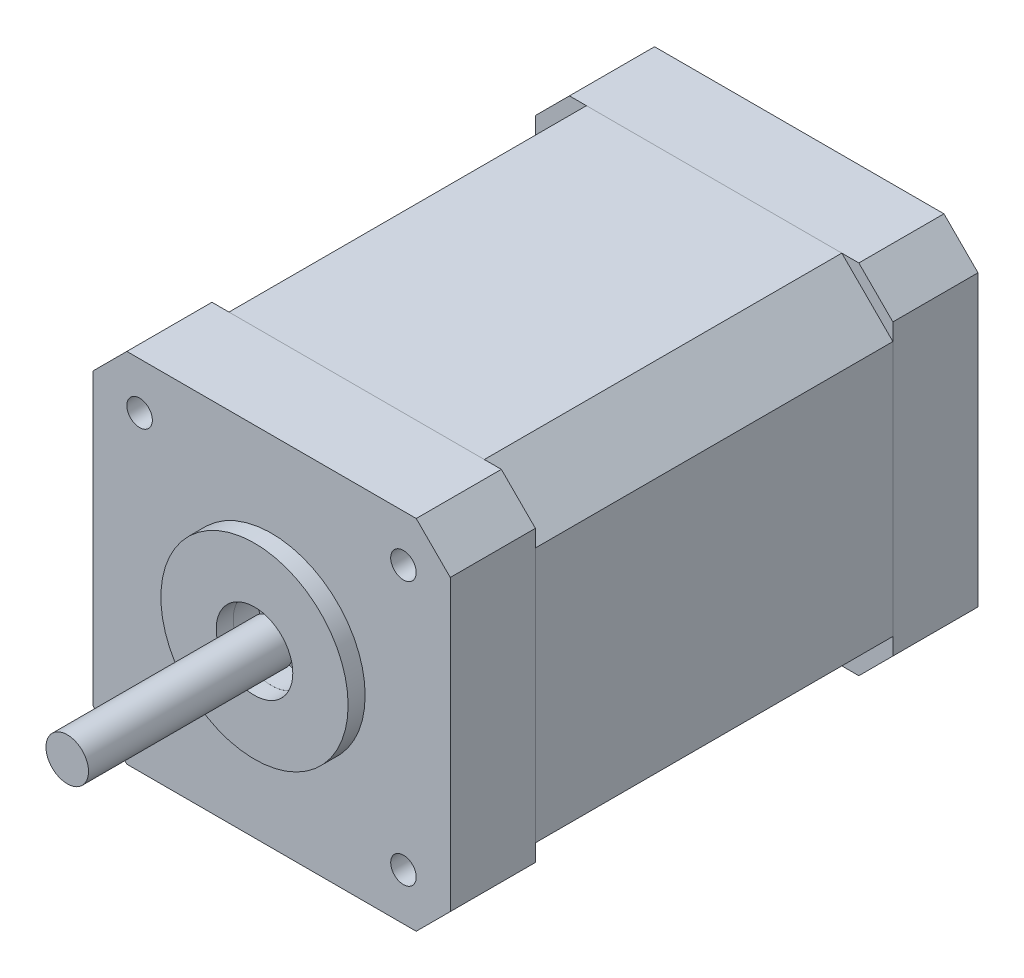
ISO-10303-21;
HEADER;
FILE_DESCRIPTION(('STEP AP214'),'2;1');
FILE_NAME('part.step','',(''),(''),'','','');
FILE_SCHEMA(('AUTOMOTIVE_DESIGN { 1 0 10303 214 1 1 1 1 }'));
ENDSEC;
DATA;
#1=APPLICATION_CONTEXT('core data for automotive mechanical design processes');
#2=APPLICATION_PROTOCOL_DEFINITION('international standard','automotive_design',2000,#1);
#3=PRODUCT_CONTEXT('',#1,'mechanical');
#4=PRODUCT('Part','Part','',(#3));
#5=PRODUCT_RELATED_PRODUCT_CATEGORY('part','',(#4));
#6=PRODUCT_DEFINITION_FORMATION('','',#4);
#7=PRODUCT_DEFINITION_CONTEXT('part definition',#1,'design');
#8=PRODUCT_DEFINITION('design','',#6,#7);
#9=PRODUCT_DEFINITION_SHAPE('','',#8);
#10=(LENGTH_UNIT() NAMED_UNIT(*) SI_UNIT(.MILLI.,.METRE.));
#11=(NAMED_UNIT(*) PLANE_ANGLE_UNIT() SI_UNIT($,.RADIAN.));
#12=(NAMED_UNIT(*) SI_UNIT($,.STERADIAN.) SOLID_ANGLE_UNIT());
#13=UNCERTAINTY_MEASURE_WITH_UNIT(LENGTH_MEASURE(1.E-05),#10,'distance_accuracy_value','');
#14=(GEOMETRIC_REPRESENTATION_CONTEXT(3) GLOBAL_UNCERTAINTY_ASSIGNED_CONTEXT((#13)) GLOBAL_UNIT_ASSIGNED_CONTEXT((#10,
#11,#12)) REPRESENTATION_CONTEXT('',''));
#15=CARTESIAN_POINT('',(0.,0.,0.));
#16=DIRECTION('',(0.,0.,1.));
#17=DIRECTION('',(1.,0.,0.));
#18=AXIS2_PLACEMENT_3D('',#15,#16,#17);
#19=CARTESIAN_POINT('',(0.,0.,84.0710678118655));
#20=DIRECTION('',(0.,0.,-1.));
#21=DIRECTION('',(-1.,0.,0.));
#22=AXIS2_PLACEMENT_3D('',#19,#20,#21);
#23=CYLINDRICAL_SURFACE('',#22,2.5);
#24=CARTESIAN_POINT('',(0.,0.,31.));
#25=DIRECTION('',(0.,0.,1.));
#26=DIRECTION('',(1.,0.,0.));
#27=AXIS2_PLACEMENT_3D('',#24,#25,#26);
#28=CIRCLE('',#27,2.5);
#29=CARTESIAN_POINT('',(2.5,0.,31.));
#30=VERTEX_POINT('',#29);
#31=EDGE_CURVE('E51',#30,#30,#28,.T.);
#32=ORIENTED_EDGE('',*,*,#31,.T.);
#33=EDGE_LOOP('',(#32));
#34=FACE_BOUND('',#33,.T.);
#35=CARTESIAN_POINT('',(0.,0.,55.));
#36=DIRECTION('',(0.,0.,1.));
#37=DIRECTION('',(1.,0.,0.));
#38=AXIS2_PLACEMENT_3D('',#35,#36,#37);
#39=CIRCLE('',#38,2.5);
#40=CARTESIAN_POINT('',(2.5,0.,55.));
#41=VERTEX_POINT('',#40);
#42=EDGE_CURVE('E11',#41,#41,#39,.T.);
#43=ORIENTED_EDGE('',*,*,#42,.F.);
#44=EDGE_LOOP('',(#43));
#45=FACE_BOUND('',#44,.T.);
#46=ADVANCED_FACE('F44',(#34,#45),#23,.T.);
#47=CARTESIAN_POINT('',(0.,0.,31.));
#48=DIRECTION('',(0.,0.,1.));
#49=DIRECTION('',(1.,0.,0.));
#50=AXIS2_PLACEMENT_3D('',#47,#48,#49);
#51=PLANE('',#50);
#52=ORIENTED_EDGE('',*,*,#31,.F.);
#53=EDGE_LOOP('',(#52));
#54=FACE_BOUND('',#53,.T.);
#55=ADVANCED_FACE('F59',(#54),#51,.F.);
#56=CARTESIAN_POINT('',(0.,0.,55.));
#57=DIRECTION('',(0.,0.,1.));
#58=DIRECTION('',(1.,0.,0.));
#59=AXIS2_PLACEMENT_3D('',#56,#57,#58);
#60=PLANE('',#59);
#61=ORIENTED_EDGE('',*,*,#42,.T.);
#62=EDGE_LOOP('',(#61));
#63=FACE_BOUND('',#62,.T.);
#64=ADVANCED_FACE('F46',(#63),#60,.T.);
#65=CLOSED_SHELL('',(#46,#55,#64));
#66=MANIFOLD_SOLID_BREP('B2',#65);
#67=CARTESIAN_POINT('',(0.,0.,33.));
#68=DIRECTION('',(0.,0.,-1.));
#69=DIRECTION('',(-1.,0.,0.));
#70=AXIS2_PLACEMENT_3D('',#67,#68,#69);
#71=CYLINDRICAL_SURFACE('',#70,11.);
#72=CARTESIAN_POINT('',(0.,0.,33.));
#73=DIRECTION('',(0.,0.,1.));
#74=DIRECTION('',(1.,0.,0.));
#75=AXIS2_PLACEMENT_3D('',#72,#73,#74);
#76=CIRCLE('',#75,11.);
#77=CARTESIAN_POINT('',(11.,0.,33.));
#78=VERTEX_POINT('',#77);
#79=EDGE_CURVE('E43',#78,#78,#76,.T.);
#80=ORIENTED_EDGE('',*,*,#79,.F.);
#81=EDGE_LOOP('',(#80));
#82=FACE_BOUND('',#81,.T.);
#83=CARTESIAN_POINT('',(0.,0.,31.));
#84=DIRECTION('',(0.,0.,1.));
#85=DIRECTION('',(1.,0.,0.));
#86=AXIS2_PLACEMENT_3D('',#83,#84,#85);
#87=CIRCLE('',#86,11.);
#88=CARTESIAN_POINT('',(11.,0.,31.));
#89=VERTEX_POINT('',#88);
#90=EDGE_CURVE('E102',#89,#89,#87,.T.);
#91=ORIENTED_EDGE('',*,*,#90,.T.);
#92=EDGE_LOOP('',(#91));
#93=FACE_BOUND('',#92,.T.);
#94=ADVANCED_FACE('F95',(#82,#93),#71,.T.);
#95=CARTESIAN_POINT('',(0.,0.,33.));
#96=DIRECTION('',(0.,0.,1.));
#97=DIRECTION('',(1.,0.,0.));
#98=AXIS2_PLACEMENT_3D('',#95,#96,#97);
#99=PLANE('',#98);
#100=CARTESIAN_POINT('',(0.,0.,33.));
#101=DIRECTION('',(0.,0.,1.));
#102=DIRECTION('',(1.,0.,0.));
#103=AXIS2_PLACEMENT_3D('',#100,#101,#102);
#104=CIRCLE('',#103,4.5);
#105=CARTESIAN_POINT('',(4.5,0.,33.));
#106=VERTEX_POINT('',#105);
#107=EDGE_CURVE('E108',#106,#106,#104,.T.);
#108=ORIENTED_EDGE('',*,*,#107,.F.);
#109=EDGE_LOOP('',(#108));
#110=FACE_BOUND('',#109,.T.);
#111=ORIENTED_EDGE('',*,*,#79,.T.);
#112=EDGE_LOOP('',(#111));
#113=FACE_BOUND('',#112,.T.);
#114=ADVANCED_FACE('F124',(#110,#113),#99,.T.);
#115=CARTESIAN_POINT('',(0.,0.,31.));
#116=DIRECTION('',(0.,0.,1.));
#117=DIRECTION('',(1.,0.,0.));
#118=AXIS2_PLACEMENT_3D('',#115,#116,#117);
#119=PLANE('',#118);
#120=CARTESIAN_POINT('',(0.,0.,31.));
#121=DIRECTION('',(0.,0.,1.));
#122=DIRECTION('',(1.,0.,0.));
#123=AXIS2_PLACEMENT_3D('',#120,#121,#122);
#124=CIRCLE('',#123,4.5);
#125=CARTESIAN_POINT('',(4.5,0.,31.));
#126=VERTEX_POINT('',#125);
#127=EDGE_CURVE('E98',#126,#126,#124,.T.);
#128=ORIENTED_EDGE('',*,*,#127,.T.);
#129=EDGE_LOOP('',(#128));
#130=FACE_BOUND('',#129,.T.);
#131=ORIENTED_EDGE('',*,*,#90,.F.);
#132=EDGE_LOOP('',(#131));
#133=FACE_BOUND('',#132,.T.);
#134=ADVANCED_FACE('F115',(#130,#133),#119,.F.);
#135=CARTESIAN_POINT('',(0.,0.,28.));
#136=DIRECTION('',(0.,0.,1.));
#137=DIRECTION('',(1.,0.,0.));
#138=AXIS2_PLACEMENT_3D('',#135,#136,#137);
#139=CYLINDRICAL_SURFACE('',#138,4.5);
#140=ORIENTED_EDGE('',*,*,#107,.T.);
#141=EDGE_LOOP('',(#140));
#142=FACE_BOUND('',#141,.T.);
#143=ORIENTED_EDGE('',*,*,#127,.F.);
#144=EDGE_LOOP('',(#143));
#145=FACE_BOUND('',#144,.T.);
#146=ADVANCED_FACE('F118',(#142,#145),#139,.F.);
#147=CLOSED_SHELL('',(#94,#114,#134,#146));
#148=MANIFOLD_SOLID_BREP('B6',#147);
#149=CARTESIAN_POINT('',(-21.,-21.,-31.));
#150=DIRECTION('',(1.,0.,0.));
#151=DIRECTION('',(0.,0.,-1.));
#152=AXIS2_PLACEMENT_3D('',#149,#150,#151);
#153=PLANE('',#152);
#154=DIRECTION('',(0.,1.,0.));
#155=VECTOR('',#154,1.);
#156=CARTESIAN_POINT('',(-21.,-21.,-31.));
#157=LINE('',#156,#155);
#158=CARTESIAN_POINT('',(-21.,-17.,-31.));
#159=VERTEX_POINT('',#158);
#160=CARTESIAN_POINT('',(-21.,17.,-31.));
#161=VERTEX_POINT('',#160);
#162=EDGE_CURVE('E256',#159,#161,#157,.T.);
#163=ORIENTED_EDGE('',*,*,#162,.F.);
#164=DIRECTION('',(0.,0.,1.));
#165=VECTOR('',#164,1.);
#166=CARTESIAN_POINT('',(-21.,-17.,-31.));
#167=LINE('',#166,#165);
#168=CARTESIAN_POINT('',(-21.,-17.,-21.));
#169=VERTEX_POINT('',#168);
#170=EDGE_CURVE('E241',#159,#169,#167,.T.);
#171=ORIENTED_EDGE('',*,*,#170,.T.);
#172=DIRECTION('',(0.,1.,0.));
#173=VECTOR('',#172,1.);
#174=CARTESIAN_POINT('',(-21.,-21.,-21.));
#175=LINE('',#174,#173);
#176=CARTESIAN_POINT('',(-21.,17.,-21.));
#177=VERTEX_POINT('',#176);
#178=EDGE_CURVE('E253',#169,#177,#175,.T.);
#179=ORIENTED_EDGE('',*,*,#178,.T.);
#180=DIRECTION('',(0.,0.,-1.));
#181=VECTOR('',#180,1.);
#182=CARTESIAN_POINT('',(-21.,17.,-31.));
#183=LINE('',#182,#181);
#184=EDGE_CURVE('E258',#177,#161,#183,.T.);
#185=ORIENTED_EDGE('',*,*,#184,.T.);
#186=EDGE_LOOP('',(#163,#171,#179,#185));
#187=FACE_BOUND('',#186,.T.);
#188=ADVANCED_FACE('F170',(#187),#153,.F.);
#189=CARTESIAN_POINT('',(21.,21.,-31.));
#190=DIRECTION('',(0.,-1.,0.));
#191=DIRECTION('',(0.,0.,-1.));
#192=AXIS2_PLACEMENT_3D('',#189,#190,#191);
#193=PLANE('',#192);
#194=DIRECTION('',(1.,0.,0.));
#195=VECTOR('',#194,1.);
#196=CARTESIAN_POINT('',(21.,21.,-31.));
#197=LINE('',#196,#195);
#198=CARTESIAN_POINT('',(-17.,21.,-31.));
#199=VERTEX_POINT('',#198);
#200=CARTESIAN_POINT('',(17.,21.,-31.));
#201=VERTEX_POINT('',#200);
#202=EDGE_CURVE('E296',#199,#201,#197,.T.);
#203=ORIENTED_EDGE('',*,*,#202,.F.);
#204=DIRECTION('',(0.,0.,1.));
#205=VECTOR('',#204,1.);
#206=CARTESIAN_POINT('',(-17.,21.,-31.));
#207=LINE('',#206,#205);
#208=CARTESIAN_POINT('',(-17.,21.,-21.));
#209=VERTEX_POINT('',#208);
#210=EDGE_CURVE('E93',#199,#209,#207,.T.);
#211=ORIENTED_EDGE('',*,*,#210,.T.);
#212=DIRECTION('',(1.,0.,0.));
#213=VECTOR('',#212,1.);
#214=CARTESIAN_POINT('',(21.,21.,-21.));
#215=LINE('',#214,#213);
#216=CARTESIAN_POINT('',(17.,21.,-21.));
#217=VERTEX_POINT('',#216);
#218=EDGE_CURVE('E263',#209,#217,#215,.T.);
#219=ORIENTED_EDGE('',*,*,#218,.T.);
#220=DIRECTION('',(0.,0.,-1.));
#221=VECTOR('',#220,1.);
#222=CARTESIAN_POINT('',(17.,21.,-31.));
#223=LINE('',#222,#221);
#224=EDGE_CURVE('E178',#217,#201,#223,.T.);
#225=ORIENTED_EDGE('',*,*,#224,.T.);
#226=EDGE_LOOP('',(#203,#211,#219,#225));
#227=FACE_BOUND('',#226,.T.);
#228=ADVANCED_FACE('F295',(#227),#193,.F.);
#229=CARTESIAN_POINT('',(21.,-21.,-31.));
#230=DIRECTION('',(-1.,0.,0.));
#231=DIRECTION('',(0.,0.,1.));
#232=AXIS2_PLACEMENT_3D('',#229,#230,#231);
#233=PLANE('',#232);
#234=DIRECTION('',(0.,-1.,0.));
#235=VECTOR('',#234,1.);
#236=CARTESIAN_POINT('',(21.,-21.,-21.));
#237=LINE('',#236,#235);
#238=CARTESIAN_POINT('',(21.,17.,-21.));
#239=VERTEX_POINT('',#238);
#240=CARTESIAN_POINT('',(21.,-17.,-21.));
#241=VERTEX_POINT('',#240);
#242=EDGE_CURVE('E266',#239,#241,#237,.T.);
#243=ORIENTED_EDGE('',*,*,#242,.T.);
#244=DIRECTION('',(0.,0.,-1.));
#245=VECTOR('',#244,1.);
#246=CARTESIAN_POINT('',(21.,-17.,-31.));
#247=LINE('',#246,#245);
#248=CARTESIAN_POINT('',(21.,-17.,-31.));
#249=VERTEX_POINT('',#248);
#250=EDGE_CURVE('E185',#241,#249,#247,.T.);
#251=ORIENTED_EDGE('',*,*,#250,.T.);
#252=DIRECTION('',(0.,-1.,0.));
#253=VECTOR('',#252,1.);
#254=CARTESIAN_POINT('',(21.,-21.,-31.));
#255=LINE('',#254,#253);
#256=CARTESIAN_POINT('',(21.,17.,-31.));
#257=VERTEX_POINT('',#256);
#258=EDGE_CURVE('E302',#257,#249,#255,.T.);
#259=ORIENTED_EDGE('',*,*,#258,.F.);
#260=DIRECTION('',(0.,0.,1.));
#261=VECTOR('',#260,1.);
#262=CARTESIAN_POINT('',(21.,17.,-31.));
#263=LINE('',#262,#261);
#264=EDGE_CURVE('E289',#257,#239,#263,.T.);
#265=ORIENTED_EDGE('',*,*,#264,.T.);
#266=EDGE_LOOP('',(#243,#251,#259,#265));
#267=FACE_BOUND('',#266,.T.);
#268=ADVANCED_FACE('F306',(#267),#233,.F.);
#269=CARTESIAN_POINT('',(21.,-21.,-31.));
#270=DIRECTION('',(0.,1.,0.));
#271=DIRECTION('',(0.,0.,1.));
#272=AXIS2_PLACEMENT_3D('',#269,#270,#271);
#273=PLANE('',#272);
#274=DIRECTION('',(-1.,0.,0.));
#275=VECTOR('',#274,1.);
#276=CARTESIAN_POINT('',(21.,-21.,-21.));
#277=LINE('',#276,#275);
#278=CARTESIAN_POINT('',(17.,-21.,-21.));
#279=VERTEX_POINT('',#278);
#280=CARTESIAN_POINT('',(-17.,-21.,-21.));
#281=VERTEX_POINT('',#280);
#282=EDGE_CURVE('E273',#279,#281,#277,.T.);
#283=ORIENTED_EDGE('',*,*,#282,.T.);
#284=DIRECTION('',(0.,0.,-1.));
#285=VECTOR('',#284,1.);
#286=CARTESIAN_POINT('',(-17.,-21.,-31.));
#287=LINE('',#286,#285);
#288=CARTESIAN_POINT('',(-17.,-21.,-31.));
#289=VERTEX_POINT('',#288);
#290=EDGE_CURVE('E242',#281,#289,#287,.T.);
#291=ORIENTED_EDGE('',*,*,#290,.T.);
#292=DIRECTION('',(-1.,0.,0.));
#293=VECTOR('',#292,1.);
#294=CARTESIAN_POINT('',(21.,-21.,-31.));
#295=LINE('',#294,#293);
#296=CARTESIAN_POINT('',(17.,-21.,-31.));
#297=VERTEX_POINT('',#296);
#298=EDGE_CURVE('E269',#297,#289,#295,.T.);
#299=ORIENTED_EDGE('',*,*,#298,.F.);
#300=DIRECTION('',(0.,0.,1.));
#301=VECTOR('',#300,1.);
#302=CARTESIAN_POINT('',(17.,-21.,-31.));
#303=LINE('',#302,#301);
#304=EDGE_CURVE('E247',#297,#279,#303,.T.);
#305=ORIENTED_EDGE('',*,*,#304,.T.);
#306=EDGE_LOOP('',(#283,#291,#299,#305));
#307=FACE_BOUND('',#306,.T.);
#308=ADVANCED_FACE('F313',(#307),#273,.F.);
#309=CARTESIAN_POINT('',(0.,0.,-31.));
#310=DIRECTION('',(0.,0.,1.));
#311=DIRECTION('',(1.,0.,0.));
#312=AXIS2_PLACEMENT_3D('',#309,#310,#311);
#313=PLANE('',#312);
#314=ORIENTED_EDGE('',*,*,#298,.T.);
#315=DIRECTION('',(0.707106781186549,-0.707106781186547,0.));
#316=VECTOR('',#315,1.);
#317=CARTESIAN_POINT('',(-21.,-17.,-31.));
#318=LINE('',#317,#316);
#319=EDGE_CURVE('E287',#289,#159,#318,.F.);
#320=ORIENTED_EDGE('',*,*,#319,.T.);
#321=ORIENTED_EDGE('',*,*,#162,.T.);
#322=DIRECTION('',(-0.707106781186546,-0.707106781186549,0.));
#323=VECTOR('',#322,1.);
#324=CARTESIAN_POINT('',(-17.,21.,-31.));
#325=LINE('',#324,#323);
#326=EDGE_CURVE('E283',#161,#199,#325,.F.);
#327=ORIENTED_EDGE('',*,*,#326,.T.);
#328=ORIENTED_EDGE('',*,*,#202,.T.);
#329=DIRECTION('',(-0.707106781186549,0.707106781186546,0.));
#330=VECTOR('',#329,1.);
#331=CARTESIAN_POINT('',(21.,17.,-31.));
#332=LINE('',#331,#330);
#333=EDGE_CURVE('E192',#201,#257,#332,.F.);
#334=ORIENTED_EDGE('',*,*,#333,.T.);
#335=ORIENTED_EDGE('',*,*,#258,.T.);
#336=DIRECTION('',(0.707106781186546,0.707106781186549,0.));
#337=VECTOR('',#336,1.);
#338=CARTESIAN_POINT('',(17.,-21.,-31.));
#339=LINE('',#338,#337);
#340=EDGE_CURVE('E285',#249,#297,#339,.F.);
#341=ORIENTED_EDGE('',*,*,#340,.T.);
#342=EDGE_LOOP('',(#314,#320,#321,#327,#328,#334,#335,#341));
#343=FACE_BOUND('',#342,.T.);
#344=ADVANCED_FACE('F300',(#343),#313,.F.);
#345=CARTESIAN_POINT('',(0.,0.,-21.));
#346=DIRECTION('',(0.,0.,1.));
#347=DIRECTION('',(1.,0.,0.));
#348=AXIS2_PLACEMENT_3D('',#345,#346,#347);
#349=PLANE('',#348);
#350=ORIENTED_EDGE('',*,*,#178,.F.);
#351=DIRECTION('',(-0.707106781186549,0.707106781186547,0.));
#352=VECTOR('',#351,1.);
#353=CARTESIAN_POINT('',(-19.,-19.,-21.));
#354=LINE('',#353,#352);
#355=EDGE_CURVE('E237',#169,#281,#354,.F.);
#356=ORIENTED_EDGE('',*,*,#355,.T.);
#357=ORIENTED_EDGE('',*,*,#282,.F.);
#358=DIRECTION('',(-0.707106781186546,-0.707106781186549,0.));
#359=VECTOR('',#358,1.);
#360=CARTESIAN_POINT('',(19.,-19.,-21.));
#361=LINE('',#360,#359);
#362=EDGE_CURVE('E248',#279,#241,#361,.F.);
#363=ORIENTED_EDGE('',*,*,#362,.T.);
#364=ORIENTED_EDGE('',*,*,#242,.F.);
#365=DIRECTION('',(0.707106781186549,-0.707106781186546,0.));
#366=VECTOR('',#365,1.);
#367=CARTESIAN_POINT('',(19.,19.,-21.));
#368=LINE('',#367,#366);
#369=EDGE_CURVE('E257',#239,#217,#368,.F.);
#370=ORIENTED_EDGE('',*,*,#369,.T.);
#371=ORIENTED_EDGE('',*,*,#218,.F.);
#372=DIRECTION('',(0.707106781186546,0.707106781186549,0.));
#373=VECTOR('',#372,1.);
#374=CARTESIAN_POINT('',(-19.,19.,-21.));
#375=LINE('',#374,#373);
#376=EDGE_CURVE('E262',#209,#177,#375,.F.);
#377=ORIENTED_EDGE('',*,*,#376,.T.);
#378=EDGE_LOOP('',(#350,#356,#357,#363,#364,#370,#371,#377));
#379=FACE_BOUND('',#378,.T.);
#380=ADVANCED_FACE('F260',(#379),#349,.T.);
#381=CARTESIAN_POINT('',(-21.,-17.,-31.));
#382=DIRECTION('',(0.707106781186547,0.707106781186549,0.));
#383=DIRECTION('',(0.,0.,1.));
#384=AXIS2_PLACEMENT_3D('',#381,#382,#383);
#385=PLANE('',#384);
#386=ORIENTED_EDGE('',*,*,#319,.F.);
#387=ORIENTED_EDGE('',*,*,#290,.F.);
#388=ORIENTED_EDGE('',*,*,#355,.F.);
#389=ORIENTED_EDGE('',*,*,#170,.F.);
#390=EDGE_LOOP('',(#386,#387,#388,#389));
#391=FACE_BOUND('',#390,.T.);
#392=ADVANCED_FACE('F240',(#391),#385,.F.);
#393=CARTESIAN_POINT('',(17.,-21.,-31.));
#394=DIRECTION('',(-0.707106781186549,0.707106781186546,0.));
#395=DIRECTION('',(0.,0.,1.));
#396=AXIS2_PLACEMENT_3D('',#393,#394,#395);
#397=PLANE('',#396);
#398=ORIENTED_EDGE('',*,*,#340,.F.);
#399=ORIENTED_EDGE('',*,*,#250,.F.);
#400=ORIENTED_EDGE('',*,*,#362,.F.);
#401=ORIENTED_EDGE('',*,*,#304,.F.);
#402=EDGE_LOOP('',(#398,#399,#400,#401));
#403=FACE_BOUND('',#402,.T.);
#404=ADVANCED_FACE('F310',(#403),#397,.F.);
#405=CARTESIAN_POINT('',(-17.,21.,-31.));
#406=DIRECTION('',(0.707106781186549,-0.707106781186546,0.));
#407=DIRECTION('',(0.,0.,1.));
#408=AXIS2_PLACEMENT_3D('',#405,#406,#407);
#409=PLANE('',#408);
#410=ORIENTED_EDGE('',*,*,#326,.F.);
#411=ORIENTED_EDGE('',*,*,#184,.F.);
#412=ORIENTED_EDGE('',*,*,#376,.F.);
#413=ORIENTED_EDGE('',*,*,#210,.F.);
#414=EDGE_LOOP('',(#410,#411,#412,#413));
#415=FACE_BOUND('',#414,.T.);
#416=ADVANCED_FACE('F316',(#415),#409,.F.);
#417=CARTESIAN_POINT('',(21.,17.,-31.));
#418=DIRECTION('',(-0.707106781186546,-0.707106781186549,0.));
#419=DIRECTION('',(0.,0.,1.));
#420=AXIS2_PLACEMENT_3D('',#417,#418,#419);
#421=PLANE('',#420);
#422=ORIENTED_EDGE('',*,*,#333,.F.);
#423=ORIENTED_EDGE('',*,*,#224,.F.);
#424=ORIENTED_EDGE('',*,*,#369,.F.);
#425=ORIENTED_EDGE('',*,*,#264,.F.);
#426=EDGE_LOOP('',(#422,#423,#424,#425));
#427=FACE_BOUND('',#426,.T.);
#428=ADVANCED_FACE('F172',(#427),#421,.F.);
#429=CLOSED_SHELL('',(#188,#228,#268,#308,#344,#380,#392,#404,#416,#428));
#430=MANIFOLD_SOLID_BREP('B38',#429);
#431=CARTESIAN_POINT('',(21.,-21.,31.));
#432=DIRECTION('',(-1.,0.,0.));
#433=DIRECTION('',(0.,0.,1.));
#434=AXIS2_PLACEMENT_3D('',#431,#432,#433);
#435=PLANE('',#434);
#436=DIRECTION('',(0.,1.,0.));
#437=VECTOR('',#436,1.);
#438=CARTESIAN_POINT('',(21.,-21.,31.));
#439=LINE('',#438,#437);
#440=CARTESIAN_POINT('',(21.,-17.,31.));
#441=VERTEX_POINT('',#440);
#442=CARTESIAN_POINT('',(21.,17.,31.));
#443=VERTEX_POINT('',#442);
#444=EDGE_CURVE('E499',#441,#443,#439,.T.);
#445=ORIENTED_EDGE('',*,*,#444,.F.);
#446=DIRECTION('',(0.,0.,-1.));
#447=VECTOR('',#446,1.);
#448=CARTESIAN_POINT('',(21.,-17.,31.));
#449=LINE('',#448,#447);
#450=CARTESIAN_POINT('',(21.,-17.,21.));
#451=VERTEX_POINT('',#450);
#452=EDGE_CURVE('E525',#441,#451,#449,.T.);
#453=ORIENTED_EDGE('',*,*,#452,.T.);
#454=DIRECTION('',(0.,1.,0.));
#455=VECTOR('',#454,1.);
#456=CARTESIAN_POINT('',(21.,-21.,21.));
#457=LINE('',#456,#455);
#458=CARTESIAN_POINT('',(21.,17.,21.));
#459=VERTEX_POINT('',#458);
#460=EDGE_CURVE('E532',#451,#459,#457,.T.);
#461=ORIENTED_EDGE('',*,*,#460,.T.);
#462=DIRECTION('',(0.,0.,1.));
#463=VECTOR('',#462,1.);
#464=CARTESIAN_POINT('',(21.,17.,31.));
#465=LINE('',#464,#463);
#466=EDGE_CURVE('E523',#459,#443,#465,.T.);
#467=ORIENTED_EDGE('',*,*,#466,.T.);
#468=EDGE_LOOP('',(#445,#453,#461,#467));
#469=FACE_BOUND('',#468,.T.);
#470=ADVANCED_FACE('F406',(#469),#435,.F.);
#471=CARTESIAN_POINT('',(-21.,21.,31.));
#472=DIRECTION('',(0.,-1.,0.));
#473=DIRECTION('',(0.,0.,-1.));
#474=AXIS2_PLACEMENT_3D('',#471,#472,#473);
#475=PLANE('',#474);
#476=DIRECTION('',(-1.,0.,0.));
#477=VECTOR('',#476,1.);
#478=CARTESIAN_POINT('',(-21.,21.,31.));
#479=LINE('',#478,#477);
#480=CARTESIAN_POINT('',(17.,21.,31.));
#481=VERTEX_POINT('',#480);
#482=CARTESIAN_POINT('',(-17.,21.,31.));
#483=VERTEX_POINT('',#482);
#484=EDGE_CURVE('E502',#481,#483,#479,.T.);
#485=ORIENTED_EDGE('',*,*,#484,.F.);
#486=DIRECTION('',(0.,0.,-1.));
#487=VECTOR('',#486,1.);
#488=CARTESIAN_POINT('',(17.,21.,31.));
#489=LINE('',#488,#487);
#490=CARTESIAN_POINT('',(17.,21.,21.));
#491=VERTEX_POINT('',#490);
#492=EDGE_CURVE('E168',#481,#491,#489,.T.);
#493=ORIENTED_EDGE('',*,*,#492,.T.);
#494=DIRECTION('',(-1.,0.,0.));
#495=VECTOR('',#494,1.);
#496=CARTESIAN_POINT('',(-21.,21.,21.));
#497=LINE('',#496,#495);
#498=CARTESIAN_POINT('',(-17.,21.,21.));
#499=VERTEX_POINT('',#498);
#500=EDGE_CURVE('E504',#491,#499,#497,.T.);
#501=ORIENTED_EDGE('',*,*,#500,.T.);
#502=DIRECTION('',(0.,0.,1.));
#503=VECTOR('',#502,1.);
#504=CARTESIAN_POINT('',(-17.,21.,31.));
#505=LINE('',#504,#503);
#506=EDGE_CURVE('E415',#499,#483,#505,.T.);
#507=ORIENTED_EDGE('',*,*,#506,.T.);
#508=EDGE_LOOP('',(#485,#493,#501,#507));
#509=FACE_BOUND('',#508,.T.);
#510=ADVANCED_FACE('F592',(#509),#475,.F.);
#511=CARTESIAN_POINT('',(-21.,-21.,31.));
#512=DIRECTION('',(1.,0.,0.));
#513=DIRECTION('',(0.,0.,-1.));
#514=AXIS2_PLACEMENT_3D('',#511,#512,#513);
#515=PLANE('',#514);
#516=DIRECTION('',(0.,-1.,0.));
#517=VECTOR('',#516,1.);
#518=CARTESIAN_POINT('',(-21.,-21.,21.));
#519=LINE('',#518,#517);
#520=CARTESIAN_POINT('',(-21.,17.,21.));
#521=VERTEX_POINT('',#520);
#522=CARTESIAN_POINT('',(-21.,-17.,21.));
#523=VERTEX_POINT('',#522);
#524=EDGE_CURVE('E500',#521,#523,#519,.T.);
#525=ORIENTED_EDGE('',*,*,#524,.T.);
#526=DIRECTION('',(0.,0.,1.));
#527=VECTOR('',#526,1.);
#528=CARTESIAN_POINT('',(-21.,-17.,31.));
#529=LINE('',#528,#527);
#530=CARTESIAN_POINT('',(-21.,-17.,31.));
#531=VERTEX_POINT('',#530);
#532=EDGE_CURVE('E478',#523,#531,#529,.T.);
#533=ORIENTED_EDGE('',*,*,#532,.T.);
#534=DIRECTION('',(0.,-1.,0.));
#535=VECTOR('',#534,1.);
#536=CARTESIAN_POINT('',(-21.,-21.,31.));
#537=LINE('',#536,#535);
#538=CARTESIAN_POINT('',(-21.,17.,31.));
#539=VERTEX_POINT('',#538);
#540=EDGE_CURVE('E542',#539,#531,#537,.T.);
#541=ORIENTED_EDGE('',*,*,#540,.F.);
#542=DIRECTION('',(0.,0.,-1.));
#543=VECTOR('',#542,1.);
#544=CARTESIAN_POINT('',(-21.,17.,31.));
#545=LINE('',#544,#543);
#546=EDGE_CURVE('E483',#539,#521,#545,.T.);
#547=ORIENTED_EDGE('',*,*,#546,.T.);
#548=EDGE_LOOP('',(#525,#533,#541,#547));
#549=FACE_BOUND('',#548,.T.);
#550=ADVANCED_FACE('F590',(#549),#515,.F.);
#551=CARTESIAN_POINT('',(-21.,-21.,31.));
#552=DIRECTION('',(0.,1.,0.));
#553=DIRECTION('',(0.,0.,1.));
#554=AXIS2_PLACEMENT_3D('',#551,#552,#553);
#555=PLANE('',#554);
#556=DIRECTION('',(1.,0.,0.));
#557=VECTOR('',#556,1.);
#558=CARTESIAN_POINT('',(-21.,-21.,31.));
#559=LINE('',#558,#557);
#560=CARTESIAN_POINT('',(-17.,-21.,31.));
#561=VERTEX_POINT('',#560);
#562=CARTESIAN_POINT('',(17.,-21.,31.));
#563=VERTEX_POINT('',#562);
#564=EDGE_CURVE('E493',#561,#563,#559,.T.);
#565=ORIENTED_EDGE('',*,*,#564,.F.);
#566=DIRECTION('',(0.,0.,-1.));
#567=VECTOR('',#566,1.);
#568=CARTESIAN_POINT('',(-17.,-21.,31.));
#569=LINE('',#568,#567);
#570=CARTESIAN_POINT('',(-17.,-21.,21.));
#571=VERTEX_POINT('',#570);
#572=EDGE_CURVE('E477',#561,#571,#569,.T.);
#573=ORIENTED_EDGE('',*,*,#572,.T.);
#574=DIRECTION('',(1.,0.,0.));
#575=VECTOR('',#574,1.);
#576=CARTESIAN_POINT('',(-21.,-21.,21.));
#577=LINE('',#576,#575);
#578=CARTESIAN_POINT('',(17.,-21.,21.));
#579=VERTEX_POINT('',#578);
#580=EDGE_CURVE('E490',#571,#579,#577,.T.);
#581=ORIENTED_EDGE('',*,*,#580,.T.);
#582=DIRECTION('',(0.,0.,1.));
#583=VECTOR('',#582,1.);
#584=CARTESIAN_POINT('',(17.,-21.,31.));
#585=LINE('',#584,#583);
#586=EDGE_CURVE('E495',#579,#563,#585,.T.);
#587=ORIENTED_EDGE('',*,*,#586,.T.);
#588=EDGE_LOOP('',(#565,#573,#581,#587));
#589=FACE_BOUND('',#588,.T.);
#590=ADVANCED_FACE('F489',(#589),#555,.F.);
#591=CARTESIAN_POINT('',(0.,0.,31.));
#592=DIRECTION('',(0.,0.,-1.));
#593=DIRECTION('',(-1.,0.,0.));
#594=AXIS2_PLACEMENT_3D('',#591,#592,#593);
#595=PLANE('',#594);
#596=CARTESIAN_POINT('',(-15.4999999999999,-15.5000000000001,31.));
#597=DIRECTION('',(0.,0.,1.));
#598=DIRECTION('',(0.,1.,0.));
#599=AXIS2_PLACEMENT_3D('',#596,#597,#598);
#600=CIRCLE('',#599,1.5);
#601=CARTESIAN_POINT('',(-15.5,-14.0000000000001,31.));
#602=VERTEX_POINT('',#601);
#603=EDGE_CURVE('E565',#602,#602,#600,.T.);
#604=ORIENTED_EDGE('',*,*,#603,.F.);
#605=EDGE_LOOP('',(#604));
#606=FACE_BOUND('',#605,.T.);
#607=CARTESIAN_POINT('',(15.5,-15.5,31.));
#608=DIRECTION('',(0.,0.,1.));
#609=DIRECTION('',(-1.,0.,0.));
#610=AXIS2_PLACEMENT_3D('',#607,#608,#609);
#611=CIRCLE('',#610,1.5);
#612=CARTESIAN_POINT('',(14.,-15.5,31.));
#613=VERTEX_POINT('',#612);
#614=EDGE_CURVE('E558',#613,#613,#611,.T.);
#615=ORIENTED_EDGE('',*,*,#614,.F.);
#616=EDGE_LOOP('',(#615));
#617=FACE_BOUND('',#616,.T.);
#618=CARTESIAN_POINT('',(15.4999999999998,15.5000000000002,31.));
#619=DIRECTION('',(0.,0.,1.));
#620=DIRECTION('',(0.,-1.,0.));
#621=AXIS2_PLACEMENT_3D('',#618,#619,#620);
#622=CIRCLE('',#621,1.5);
#623=CARTESIAN_POINT('',(15.4999999999999,14.0000000000002,31.));
#624=VERTEX_POINT('',#623);
#625=EDGE_CURVE('E559',#624,#624,#622,.T.);
#626=ORIENTED_EDGE('',*,*,#625,.F.);
#627=EDGE_LOOP('',(#626));
#628=FACE_BOUND('',#627,.T.);
#629=CARTESIAN_POINT('',(-15.5,15.5,31.));
#630=DIRECTION('',(0.,0.,1.));
#631=DIRECTION('',(1.,0.,0.));
#632=AXIS2_PLACEMENT_3D('',#629,#630,#631);
#633=CIRCLE('',#632,1.5);
#634=CARTESIAN_POINT('',(-14.,15.5,31.));
#635=VERTEX_POINT('',#634);
#636=EDGE_CURVE('E549',#635,#635,#633,.T.);
#637=ORIENTED_EDGE('',*,*,#636,.F.);
#638=EDGE_LOOP('',(#637));
#639=FACE_BOUND('',#638,.T.);
#640=CARTESIAN_POINT('',(0.,0.,31.));
#641=DIRECTION('',(0.,0.,-1.));
#642=DIRECTION('',(-1.,0.,0.));
#643=AXIS2_PLACEMENT_3D('',#640,#641,#642);
#644=CIRCLE('',#643,4.5);
#645=CARTESIAN_POINT('',(-4.5,0.,31.));
#646=VERTEX_POINT('',#645);
#647=EDGE_CURVE('E410',#646,#646,#644,.T.);
#648=ORIENTED_EDGE('',*,*,#647,.T.);
#649=EDGE_LOOP('',(#648));
#650=FACE_BOUND('',#649,.T.);
#651=ORIENTED_EDGE('',*,*,#540,.T.);
#652=DIRECTION('',(-0.707106781186546,0.707106781186549,0.));
#653=VECTOR('',#652,1.);
#654=CARTESIAN_POINT('',(-17.,-21.,31.));
#655=LINE('',#654,#653);
#656=EDGE_CURVE('E521',#531,#561,#655,.F.);
#657=ORIENTED_EDGE('',*,*,#656,.T.);
#658=ORIENTED_EDGE('',*,*,#564,.T.);
#659=DIRECTION('',(-0.707106781186549,-0.707106781186546,0.));
#660=VECTOR('',#659,1.);
#661=CARTESIAN_POINT('',(21.,-17.,31.));
#662=LINE('',#661,#660);
#663=EDGE_CURVE('E519',#563,#441,#662,.F.);
#664=ORIENTED_EDGE('',*,*,#663,.T.);
#665=ORIENTED_EDGE('',*,*,#444,.T.);
#666=DIRECTION('',(0.707106781186546,-0.707106781186549,0.));
#667=VECTOR('',#666,1.);
#668=CARTESIAN_POINT('',(17.,21.,31.));
#669=LINE('',#668,#667);
#670=EDGE_CURVE('E428',#443,#481,#669,.F.);
#671=ORIENTED_EDGE('',*,*,#670,.T.);
#672=ORIENTED_EDGE('',*,*,#484,.T.);
#673=DIRECTION('',(0.707106781186549,0.707106781186546,0.));
#674=VECTOR('',#673,1.);
#675=CARTESIAN_POINT('',(-21.,17.,31.));
#676=LINE('',#675,#674);
#677=EDGE_CURVE('E516',#483,#539,#676,.F.);
#678=ORIENTED_EDGE('',*,*,#677,.T.);
#679=EDGE_LOOP('',(#651,#657,#658,#664,#665,#671,#672,#678));
#680=FACE_BOUND('',#679,.T.);
#681=ADVANCED_FACE('F575',(#606,#617,#628,#639,#650,#680),#595,.F.);
#682=CARTESIAN_POINT('',(0.,0.,21.));
#683=DIRECTION('',(0.,0.,-1.));
#684=DIRECTION('',(-1.,0.,0.));
#685=AXIS2_PLACEMENT_3D('',#682,#683,#684);
#686=PLANE('',#685);
#687=ORIENTED_EDGE('',*,*,#580,.F.);
#688=DIRECTION('',(0.707106781186546,-0.707106781186549,0.));
#689=VECTOR('',#688,1.);
#690=CARTESIAN_POINT('',(-19.,-19.,21.));
#691=LINE('',#690,#689);
#692=EDGE_CURVE('E473',#571,#523,#691,.F.);
#693=ORIENTED_EDGE('',*,*,#692,.T.);
#694=ORIENTED_EDGE('',*,*,#524,.F.);
#695=DIRECTION('',(-0.707106781186549,-0.707106781186546,0.));
#696=VECTOR('',#695,1.);
#697=CARTESIAN_POINT('',(-18.9999999999999,19.,21.));
#698=LINE('',#697,#696);
#699=EDGE_CURVE('E494',#521,#499,#698,.F.);
#700=ORIENTED_EDGE('',*,*,#699,.T.);
#701=ORIENTED_EDGE('',*,*,#500,.F.);
#702=DIRECTION('',(-0.707106781186546,0.707106781186549,0.));
#703=VECTOR('',#702,1.);
#704=CARTESIAN_POINT('',(19.,18.9999999999999,21.));
#705=LINE('',#704,#703);
#706=EDGE_CURVE('E510',#491,#459,#705,.F.);
#707=ORIENTED_EDGE('',*,*,#706,.T.);
#708=ORIENTED_EDGE('',*,*,#460,.F.);
#709=DIRECTION('',(0.707106781186549,0.707106781186546,0.));
#710=VECTOR('',#709,1.);
#711=CARTESIAN_POINT('',(19.,-19.,21.));
#712=LINE('',#711,#710);
#713=EDGE_CURVE('E484',#451,#579,#712,.F.);
#714=ORIENTED_EDGE('',*,*,#713,.T.);
#715=EDGE_LOOP('',(#687,#693,#694,#700,#701,#707,#708,#714));
#716=FACE_BOUND('',#715,.T.);
#717=ADVANCED_FACE('F497',(#716),#686,.T.);
#718=CARTESIAN_POINT('',(-17.,-21.,31.));
#719=DIRECTION('',(0.707106781186549,0.707106781186546,0.));
#720=DIRECTION('',(0.,0.,-1.));
#721=AXIS2_PLACEMENT_3D('',#718,#719,#720);
#722=PLANE('',#721);
#723=ORIENTED_EDGE('',*,*,#656,.F.);
#724=ORIENTED_EDGE('',*,*,#532,.F.);
#725=ORIENTED_EDGE('',*,*,#692,.F.);
#726=ORIENTED_EDGE('',*,*,#572,.F.);
#727=EDGE_LOOP('',(#723,#724,#725,#726));
#728=FACE_BOUND('',#727,.T.);
#729=ADVANCED_FACE('F476',(#728),#722,.F.);
#730=CARTESIAN_POINT('',(21.,-17.,31.));
#731=DIRECTION('',(-0.707106781186546,0.707106781186549,0.));
#732=DIRECTION('',(0.,0.,-1.));
#733=AXIS2_PLACEMENT_3D('',#730,#731,#732);
#734=PLANE('',#733);
#735=ORIENTED_EDGE('',*,*,#663,.F.);
#736=ORIENTED_EDGE('',*,*,#586,.F.);
#737=ORIENTED_EDGE('',*,*,#713,.F.);
#738=ORIENTED_EDGE('',*,*,#452,.F.);
#739=EDGE_LOOP('',(#735,#736,#737,#738));
#740=FACE_BOUND('',#739,.T.);
#741=ADVANCED_FACE('F596',(#740),#734,.F.);
#742=CARTESIAN_POINT('',(17.,21.,31.));
#743=DIRECTION('',(-0.707106781186549,-0.707106781186546,0.));
#744=DIRECTION('',(0.,0.,-1.));
#745=AXIS2_PLACEMENT_3D('',#742,#743,#744);
#746=PLANE('',#745);
#747=ORIENTED_EDGE('',*,*,#670,.F.);
#748=ORIENTED_EDGE('',*,*,#466,.F.);
#749=ORIENTED_EDGE('',*,*,#706,.F.);
#750=ORIENTED_EDGE('',*,*,#492,.F.);
#751=EDGE_LOOP('',(#747,#748,#749,#750));
#752=FACE_BOUND('',#751,.T.);
#753=ADVANCED_FACE('F595',(#752),#746,.F.);
#754=CARTESIAN_POINT('',(-21.,17.,31.));
#755=DIRECTION('',(0.707106781186546,-0.707106781186549,0.));
#756=DIRECTION('',(0.,0.,-1.));
#757=AXIS2_PLACEMENT_3D('',#754,#755,#756);
#758=PLANE('',#757);
#759=ORIENTED_EDGE('',*,*,#677,.F.);
#760=ORIENTED_EDGE('',*,*,#506,.F.);
#761=ORIENTED_EDGE('',*,*,#699,.F.);
#762=ORIENTED_EDGE('',*,*,#546,.F.);
#763=EDGE_LOOP('',(#759,#760,#761,#762));
#764=FACE_BOUND('',#763,.T.);
#765=ADVANCED_FACE('F408',(#764),#758,.F.);
#766=CARTESIAN_POINT('',(0.,0.,28.));
#767=DIRECTION('',(0.,0.,1.));
#768=DIRECTION('',(1.,0.,0.));
#769=AXIS2_PLACEMENT_3D('',#766,#767,#768);
#770=CYLINDRICAL_SURFACE('',#769,4.5);
#771=CARTESIAN_POINT('',(0.,0.,28.));
#772=DIRECTION('',(0.,0.,1.));
#773=DIRECTION('',(1.,0.,0.));
#774=AXIS2_PLACEMENT_3D('',#771,#772,#773);
#775=CIRCLE('',#774,4.5);
#776=CARTESIAN_POINT('',(4.5,0.,28.));
#777=VERTEX_POINT('',#776);
#778=EDGE_CURVE('E539',#777,#777,#775,.T.);
#779=ORIENTED_EDGE('',*,*,#778,.F.);
#780=EDGE_LOOP('',(#779));
#781=FACE_BOUND('',#780,.T.);
#782=ORIENTED_EDGE('',*,*,#647,.F.);
#783=EDGE_LOOP('',(#782));
#784=FACE_BOUND('',#783,.T.);
#785=ADVANCED_FACE('F617',(#781,#784),#770,.F.);
#786=CARTESIAN_POINT('',(0.,0.,28.));
#787=DIRECTION('',(0.,0.,1.));
#788=DIRECTION('',(1.,0.,0.));
#789=AXIS2_PLACEMENT_3D('',#786,#787,#788);
#790=PLANE('',#789);
#791=ORIENTED_EDGE('',*,*,#778,.T.);
#792=EDGE_LOOP('',(#791));
#793=FACE_BOUND('',#792,.T.);
#794=ADVANCED_FACE('F620',(#793),#790,.T.);
#795=CARTESIAN_POINT('',(-15.5,15.5,26.5));
#796=DIRECTION('',(0.,0.,1.));
#797=DIRECTION('',(1.,0.,0.));
#798=AXIS2_PLACEMENT_3D('',#795,#796,#797);
#799=CYLINDRICAL_SURFACE('',#798,1.5);
#800=CARTESIAN_POINT('',(-15.5,15.5,26.5));
#801=DIRECTION('',(0.,0.,1.));
#802=DIRECTION('',(1.,0.,0.));
#803=AXIS2_PLACEMENT_3D('',#800,#801,#802);
#804=CIRCLE('',#803,1.5);
#805=CARTESIAN_POINT('',(-14.,15.5,26.5));
#806=VERTEX_POINT('',#805);
#807=EDGE_CURVE('E548',#806,#806,#804,.T.);
#808=ORIENTED_EDGE('',*,*,#807,.F.);
#809=EDGE_LOOP('',(#808));
#810=FACE_BOUND('',#809,.T.);
#811=ORIENTED_EDGE('',*,*,#636,.T.);
#812=EDGE_LOOP('',(#811));
#813=FACE_BOUND('',#812,.T.);
#814=ADVANCED_FACE('F624',(#810,#813),#799,.F.);
#815=CARTESIAN_POINT('',(-15.5,15.5,26.5));
#816=DIRECTION('',(0.,0.,1.));
#817=DIRECTION('',(1.,0.,0.));
#818=AXIS2_PLACEMENT_3D('',#815,#816,#817);
#819=PLANE('',#818);
#820=ORIENTED_EDGE('',*,*,#807,.T.);
#821=EDGE_LOOP('',(#820));
#822=FACE_BOUND('',#821,.T.);
#823=ADVANCED_FACE('F628',(#822),#819,.T.);
#824=CARTESIAN_POINT('',(15.4999999999998,15.5000000000002,26.5));
#825=DIRECTION('',(0.,0.,1.));
#826=DIRECTION('',(0.,-1.,0.));
#827=AXIS2_PLACEMENT_3D('',#824,#825,#826);
#828=CYLINDRICAL_SURFACE('',#827,1.5);
#829=CARTESIAN_POINT('',(15.4999999999998,15.5000000000002,26.5));
#830=DIRECTION('',(0.,0.,1.));
#831=DIRECTION('',(0.,-1.,0.));
#832=AXIS2_PLACEMENT_3D('',#829,#830,#831);
#833=CIRCLE('',#832,1.5);
#834=CARTESIAN_POINT('',(15.4999999999999,14.0000000000002,26.5));
#835=VERTEX_POINT('',#834);
#836=EDGE_CURVE('E555',#835,#835,#833,.T.);
#837=ORIENTED_EDGE('',*,*,#836,.F.);
#838=EDGE_LOOP('',(#837));
#839=FACE_BOUND('',#838,.T.);
#840=ORIENTED_EDGE('',*,*,#625,.T.);
#841=EDGE_LOOP('',(#840));
#842=FACE_BOUND('',#841,.T.);
#843=ADVANCED_FACE('F632',(#839,#842),#828,.F.);
#844=CARTESIAN_POINT('',(15.4999999999998,15.5000000000002,26.5));
#845=DIRECTION('',(0.,0.,1.));
#846=DIRECTION('',(0.,-1.,0.));
#847=AXIS2_PLACEMENT_3D('',#844,#845,#846);
#848=PLANE('',#847);
#849=ORIENTED_EDGE('',*,*,#836,.T.);
#850=EDGE_LOOP('',(#849));
#851=FACE_BOUND('',#850,.T.);
#852=ADVANCED_FACE('F636',(#851),#848,.T.);
#853=CARTESIAN_POINT('',(15.5,-15.5,26.5));
#854=DIRECTION('',(0.,0.,1.));
#855=DIRECTION('',(-1.,0.,0.));
#856=AXIS2_PLACEMENT_3D('',#853,#854,#855);
#857=CYLINDRICAL_SURFACE('',#856,1.5);
#858=CARTESIAN_POINT('',(15.5,-15.5,26.5));
#859=DIRECTION('',(0.,0.,1.));
#860=DIRECTION('',(-1.,0.,0.));
#861=AXIS2_PLACEMENT_3D('',#858,#859,#860);
#862=CIRCLE('',#861,1.5);
#863=CARTESIAN_POINT('',(14.,-15.5,26.5));
#864=VERTEX_POINT('',#863);
#865=EDGE_CURVE('E562',#864,#864,#862,.T.);
#866=ORIENTED_EDGE('',*,*,#865,.F.);
#867=EDGE_LOOP('',(#866));
#868=FACE_BOUND('',#867,.T.);
#869=ORIENTED_EDGE('',*,*,#614,.T.);
#870=EDGE_LOOP('',(#869));
#871=FACE_BOUND('',#870,.T.);
#872=ADVANCED_FACE('F640',(#868,#871),#857,.F.);
#873=CARTESIAN_POINT('',(15.5,-15.5,26.5));
#874=DIRECTION('',(0.,0.,1.));
#875=DIRECTION('',(-1.,0.,0.));
#876=AXIS2_PLACEMENT_3D('',#873,#874,#875);
#877=PLANE('',#876);
#878=ORIENTED_EDGE('',*,*,#865,.T.);
#879=EDGE_LOOP('',(#878));
#880=FACE_BOUND('',#879,.T.);
#881=ADVANCED_FACE('F644',(#880),#877,.T.);
#882=CARTESIAN_POINT('',(-15.4999999999999,-15.5000000000001,26.5));
#883=DIRECTION('',(0.,0.,1.));
#884=DIRECTION('',(0.,1.,0.));
#885=AXIS2_PLACEMENT_3D('',#882,#883,#884);
#886=CYLINDRICAL_SURFACE('',#885,1.5);
#887=CARTESIAN_POINT('',(-15.4999999999999,-15.5000000000001,26.5));
#888=DIRECTION('',(0.,0.,1.));
#889=DIRECTION('',(0.,1.,0.));
#890=AXIS2_PLACEMENT_3D('',#887,#888,#889);
#891=CIRCLE('',#890,1.5);
#892=CARTESIAN_POINT('',(-15.5,-14.0000000000001,26.5));
#893=VERTEX_POINT('',#892);
#894=EDGE_CURVE('E552',#893,#893,#891,.T.);
#895=ORIENTED_EDGE('',*,*,#894,.F.);
#896=EDGE_LOOP('',(#895));
#897=FACE_BOUND('',#896,.T.);
#898=ORIENTED_EDGE('',*,*,#603,.T.);
#899=EDGE_LOOP('',(#898));
#900=FACE_BOUND('',#899,.T.);
#901=ADVANCED_FACE('F573',(#897,#900),#886,.F.);
#902=CARTESIAN_POINT('',(-15.4999999999999,-15.5000000000001,26.5));
#903=DIRECTION('',(0.,0.,1.));
#904=DIRECTION('',(0.,1.,0.));
#905=AXIS2_PLACEMENT_3D('',#902,#903,#904);
#906=PLANE('',#905);
#907=ORIENTED_EDGE('',*,*,#894,.T.);
#908=EDGE_LOOP('',(#907));
#909=FACE_BOUND('',#908,.T.);
#910=ADVANCED_FACE('F651',(#909),#906,.T.);
#911=CLOSED_SHELL('',(#470,#510,#550,#590,#681,#717,#729,#741,#753,#765,#785,#794,#814,#823,
#843,#852,#872,#881,#901,#910));
#912=MANIFOLD_SOLID_BREP('B87',#911);
#913=CARTESIAN_POINT('',(21.,-21.,21.));
#914=DIRECTION('',(-1.,0.,0.));
#915=DIRECTION('',(0.,0.,1.));
#916=AXIS2_PLACEMENT_3D('',#913,#914,#915);
#917=PLANE('',#916);
#918=DIRECTION('',(0.,1.,0.));
#919=VECTOR('',#918,1.);
#920=CARTESIAN_POINT('',(21.,-21.,-21.));
#921=LINE('',#920,#919);
#922=CARTESIAN_POINT('',(21.,-15.,-21.));
#923=VERTEX_POINT('',#922);
#924=CARTESIAN_POINT('',(21.,15.,-21.));
#925=VERTEX_POINT('',#924);
#926=EDGE_CURVE('E907',#923,#925,#921,.T.);
#927=ORIENTED_EDGE('',*,*,#926,.T.);
#928=DIRECTION('',(0.,0.,1.));
#929=VECTOR('',#928,1.);
#930=CARTESIAN_POINT('',(21.,15.,21.));
#931=LINE('',#930,#929);
#932=CARTESIAN_POINT('',(21.,15.,21.));
#933=VERTEX_POINT('',#932);
#934=EDGE_CURVE('E885',#925,#933,#931,.T.);
#935=ORIENTED_EDGE('',*,*,#934,.T.);
#936=DIRECTION('',(0.,1.,0.));
#937=VECTOR('',#936,1.);
#938=CARTESIAN_POINT('',(21.,-21.,21.));
#939=LINE('',#938,#937);
#940=CARTESIAN_POINT('',(21.,-15.,21.));
#941=VERTEX_POINT('',#940);
#942=EDGE_CURVE('E916',#941,#933,#939,.T.);
#943=ORIENTED_EDGE('',*,*,#942,.F.);
#944=DIRECTION('',(0.,0.,-1.));
#945=VECTOR('',#944,1.);
#946=CARTESIAN_POINT('',(21.,-15.,21.));
#947=LINE('',#946,#945);
#948=EDGE_CURVE('E890',#941,#923,#947,.T.);
#949=ORIENTED_EDGE('',*,*,#948,.T.);
#950=EDGE_LOOP('',(#927,#935,#943,#949));
#951=FACE_BOUND('',#950,.T.);
#952=ADVANCED_FACE('F814',(#951),#917,.F.);
#953=CARTESIAN_POINT('',(-21.,21.,21.));
#954=DIRECTION('',(0.,-1.,0.));
#955=DIRECTION('',(0.,0.,-1.));
#956=AXIS2_PLACEMENT_3D('',#953,#954,#955);
#957=PLANE('',#956);
#958=DIRECTION('',(-1.,0.,0.));
#959=VECTOR('',#958,1.);
#960=CARTESIAN_POINT('',(-21.,21.,21.));
#961=LINE('',#960,#959);
#962=CARTESIAN_POINT('',(15.,21.,21.));
#963=VERTEX_POINT('',#962);
#964=CARTESIAN_POINT('',(-15.,21.,21.));
#965=VERTEX_POINT('',#964);
#966=EDGE_CURVE('E900',#963,#965,#961,.T.);
#967=ORIENTED_EDGE('',*,*,#966,.F.);
#968=DIRECTION('',(0.,0.,-1.));
#969=VECTOR('',#968,1.);
#970=CARTESIAN_POINT('',(15.,21.,21.));
#971=LINE('',#970,#969);
#972=CARTESIAN_POINT('',(15.,21.,-21.));
#973=VERTEX_POINT('',#972);
#974=EDGE_CURVE('E884',#963,#973,#971,.T.);
#975=ORIENTED_EDGE('',*,*,#974,.T.);
#976=DIRECTION('',(-1.,0.,0.));
#977=VECTOR('',#976,1.);
#978=CARTESIAN_POINT('',(-21.,21.,-21.));
#979=LINE('',#978,#977);
#980=CARTESIAN_POINT('',(-15.,21.,-21.));
#981=VERTEX_POINT('',#980);
#982=EDGE_CURVE('E897',#973,#981,#979,.T.);
#983=ORIENTED_EDGE('',*,*,#982,.T.);
#984=DIRECTION('',(0.,0.,1.));
#985=VECTOR('',#984,1.);
#986=CARTESIAN_POINT('',(-15.,21.,21.));
#987=LINE('',#986,#985);
#988=EDGE_CURVE('E902',#981,#965,#987,.T.);
#989=ORIENTED_EDGE('',*,*,#988,.T.);
#990=EDGE_LOOP('',(#967,#975,#983,#989));
#991=FACE_BOUND('',#990,.T.);
#992=ADVANCED_FACE('F896',(#991),#957,.F.);
#993=CARTESIAN_POINT('',(-21.,-21.,21.));
#994=DIRECTION('',(1.,0.,0.));
#995=DIRECTION('',(0.,0.,-1.));
#996=AXIS2_PLACEMENT_3D('',#993,#994,#995);
#997=PLANE('',#996);
#998=DIRECTION('',(0.,-1.,0.));
#999=VECTOR('',#998,1.);
#1000=CARTESIAN_POINT('',(-21.,-21.,-21.));
#1001=LINE('',#1000,#999);
#1002=CARTESIAN_POINT('',(-21.,15.,-21.));
#1003=VERTEX_POINT('',#1002);
#1004=CARTESIAN_POINT('',(-21.,-15.,-21.));
#1005=VERTEX_POINT('',#1004);
#1006=EDGE_CURVE('E906',#1003,#1005,#1001,.T.);
#1007=ORIENTED_EDGE('',*,*,#1006,.T.);
#1008=DIRECTION('',(0.,0.,1.));
#1009=VECTOR('',#1008,1.);
#1010=CARTESIAN_POINT('',(-21.,-15.,21.));
#1011=LINE('',#1010,#1009);
#1012=CARTESIAN_POINT('',(-21.,-15.,21.));
#1013=VERTEX_POINT('',#1012);
#1014=EDGE_CURVE('E404',#1005,#1013,#1011,.T.);
#1015=ORIENTED_EDGE('',*,*,#1014,.T.);
#1016=DIRECTION('',(0.,-1.,0.));
#1017=VECTOR('',#1016,1.);
#1018=CARTESIAN_POINT('',(-21.,-21.,21.));
#1019=LINE('',#1018,#1017);
#1020=CARTESIAN_POINT('',(-21.,15.,21.));
#1021=VERTEX_POINT('',#1020);
#1022=EDGE_CURVE('E942',#1021,#1013,#1019,.T.);
#1023=ORIENTED_EDGE('',*,*,#1022,.F.);
#1024=DIRECTION('',(0.,0.,-1.));
#1025=VECTOR('',#1024,1.);
#1026=CARTESIAN_POINT('',(-21.,15.,21.));
#1027=LINE('',#1026,#1025);
#1028=EDGE_CURVE('E822',#1021,#1003,#1027,.T.);
#1029=ORIENTED_EDGE('',*,*,#1028,.T.);
#1030=EDGE_LOOP('',(#1007,#1015,#1023,#1029));
#1031=FACE_BOUND('',#1030,.T.);
#1032=ADVANCED_FACE('F940',(#1031),#997,.F.);
#1033=CARTESIAN_POINT('',(-21.,-21.,21.));
#1034=DIRECTION('',(0.,1.,0.));
#1035=DIRECTION('',(0.,0.,1.));
#1036=AXIS2_PLACEMENT_3D('',#1033,#1034,#1035);
#1037=PLANE('',#1036);
#1038=DIRECTION('',(1.,0.,0.));
#1039=VECTOR('',#1038,1.);
#1040=CARTESIAN_POINT('',(-21.,-21.,-21.));
#1041=LINE('',#1040,#1039);
#1042=CARTESIAN_POINT('',(-15.,-21.,-21.));
#1043=VERTEX_POINT('',#1042);
#1044=CARTESIAN_POINT('',(15.,-21.,-21.));
#1045=VERTEX_POINT('',#1044);
#1046=EDGE_CURVE('E910',#1043,#1045,#1041,.T.);
#1047=ORIENTED_EDGE('',*,*,#1046,.T.);
#1048=DIRECTION('',(0.,0.,1.));
#1049=VECTOR('',#1048,1.);
#1050=CARTESIAN_POINT('',(15.,-21.,21.));
#1051=LINE('',#1050,#1049);
#1052=CARTESIAN_POINT('',(15.,-21.,21.));
#1053=VERTEX_POINT('',#1052);
#1054=EDGE_CURVE('E829',#1045,#1053,#1051,.T.);
#1055=ORIENTED_EDGE('',*,*,#1054,.T.);
#1056=DIRECTION('',(1.,0.,0.));
#1057=VECTOR('',#1056,1.);
#1058=CARTESIAN_POINT('',(-21.,-21.,21.));
#1059=LINE('',#1058,#1057);
#1060=CARTESIAN_POINT('',(-15.,-21.,21.));
#1061=VERTEX_POINT('',#1060);
#1062=EDGE_CURVE('E917',#1061,#1053,#1059,.T.);
#1063=ORIENTED_EDGE('',*,*,#1062,.F.);
#1064=DIRECTION('',(0.,0.,-1.));
#1065=VECTOR('',#1064,1.);
#1066=CARTESIAN_POINT('',(-15.,-21.,21.));
#1067=LINE('',#1066,#1065);
#1068=EDGE_CURVE('E933',#1061,#1043,#1067,.T.);
#1069=ORIENTED_EDGE('',*,*,#1068,.T.);
#1070=EDGE_LOOP('',(#1047,#1055,#1063,#1069));
#1071=FACE_BOUND('',#1070,.T.);
#1072=ADVANCED_FACE('F949',(#1071),#1037,.F.);
#1073=CARTESIAN_POINT('',(0.,0.,21.));
#1074=DIRECTION('',(0.,0.,-1.));
#1075=DIRECTION('',(-1.,0.,0.));
#1076=AXIS2_PLACEMENT_3D('',#1073,#1074,#1075);
#1077=PLANE('',#1076);
#1078=ORIENTED_EDGE('',*,*,#942,.T.);
#1079=DIRECTION('',(0.707106781186546,-0.707106781186549,0.));
#1080=VECTOR('',#1079,1.);
#1081=CARTESIAN_POINT('',(15.,21.,21.));
#1082=LINE('',#1081,#1080);
#1083=EDGE_CURVE('E931',#933,#963,#1082,.F.);
#1084=ORIENTED_EDGE('',*,*,#1083,.T.);
#1085=ORIENTED_EDGE('',*,*,#966,.T.);
#1086=DIRECTION('',(0.707106781186549,0.707106781186546,0.));
#1087=VECTOR('',#1086,1.);
#1088=CARTESIAN_POINT('',(-21.,15.,21.));
#1089=LINE('',#1088,#1087);
#1090=EDGE_CURVE('E926',#965,#1021,#1089,.F.);
#1091=ORIENTED_EDGE('',*,*,#1090,.T.);
#1092=ORIENTED_EDGE('',*,*,#1022,.T.);
#1093=DIRECTION('',(-0.707106781186546,0.707106781186549,0.));
#1094=VECTOR('',#1093,1.);
#1095=CARTESIAN_POINT('',(-15.,-21.,21.));
#1096=LINE('',#1095,#1094);
#1097=EDGE_CURVE('E836',#1013,#1061,#1096,.F.);
#1098=ORIENTED_EDGE('',*,*,#1097,.T.);
#1099=ORIENTED_EDGE('',*,*,#1062,.T.);
#1100=DIRECTION('',(-0.707106781186549,-0.707106781186546,0.));
#1101=VECTOR('',#1100,1.);
#1102=CARTESIAN_POINT('',(21.,-15.,21.));
#1103=LINE('',#1102,#1101);
#1104=EDGE_CURVE('E929',#1053,#941,#1103,.F.);
#1105=ORIENTED_EDGE('',*,*,#1104,.T.);
#1106=EDGE_LOOP('',(#1078,#1084,#1085,#1091,#1092,#1098,#1099,#1105));
#1107=FACE_BOUND('',#1106,.T.);
#1108=ADVANCED_FACE('F956',(#1107),#1077,.F.);
#1109=CARTESIAN_POINT('',(0.,0.,-21.));
#1110=DIRECTION('',(0.,0.,-1.));
#1111=DIRECTION('',(-1.,0.,0.));
#1112=AXIS2_PLACEMENT_3D('',#1109,#1110,#1111);
#1113=PLANE('',#1112);
#1114=ORIENTED_EDGE('',*,*,#982,.F.);
#1115=DIRECTION('',(-0.707106781186546,0.707106781186549,0.));
#1116=VECTOR('',#1115,1.);
#1117=CARTESIAN_POINT('',(18.,18.,-21.));
#1118=LINE('',#1117,#1116);
#1119=EDGE_CURVE('E880',#973,#925,#1118,.F.);
#1120=ORIENTED_EDGE('',*,*,#1119,.T.);
#1121=ORIENTED_EDGE('',*,*,#926,.F.);
#1122=DIRECTION('',(0.707106781186549,0.707106781186546,0.));
#1123=VECTOR('',#1122,1.);
#1124=CARTESIAN_POINT('',(18.,-18.,-21.));
#1125=LINE('',#1124,#1123);
#1126=EDGE_CURVE('E891',#923,#1045,#1125,.F.);
#1127=ORIENTED_EDGE('',*,*,#1126,.T.);
#1128=ORIENTED_EDGE('',*,*,#1046,.F.);
#1129=DIRECTION('',(0.707106781186546,-0.707106781186549,0.));
#1130=VECTOR('',#1129,1.);
#1131=CARTESIAN_POINT('',(-18.,-18.,-21.));
#1132=LINE('',#1131,#1130);
#1133=EDGE_CURVE('E920',#1043,#1005,#1132,.F.);
#1134=ORIENTED_EDGE('',*,*,#1133,.T.);
#1135=ORIENTED_EDGE('',*,*,#1006,.F.);
#1136=DIRECTION('',(-0.707106781186549,-0.707106781186546,0.));
#1137=VECTOR('',#1136,1.);
#1138=CARTESIAN_POINT('',(-18.,18.,-21.));
#1139=LINE('',#1138,#1137);
#1140=EDGE_CURVE('E901',#1003,#981,#1139,.F.);
#1141=ORIENTED_EDGE('',*,*,#1140,.T.);
#1142=EDGE_LOOP('',(#1114,#1120,#1121,#1127,#1128,#1134,#1135,#1141));
#1143=FACE_BOUND('',#1142,.T.);
#1144=ADVANCED_FACE('F904',(#1143),#1113,.T.);
#1145=CARTESIAN_POINT('',(15.,21.,21.));
#1146=DIRECTION('',(-0.707106781186549,-0.707106781186546,0.));
#1147=DIRECTION('',(0.,0.,-1.));
#1148=AXIS2_PLACEMENT_3D('',#1145,#1146,#1147);
#1149=PLANE('',#1148);
#1150=ORIENTED_EDGE('',*,*,#1083,.F.);
#1151=ORIENTED_EDGE('',*,*,#934,.F.);
#1152=ORIENTED_EDGE('',*,*,#1119,.F.);
#1153=ORIENTED_EDGE('',*,*,#974,.F.);
#1154=EDGE_LOOP('',(#1150,#1151,#1152,#1153));
#1155=FACE_BOUND('',#1154,.T.);
#1156=ADVANCED_FACE('F883',(#1155),#1149,.F.);
#1157=CARTESIAN_POINT('',(21.,-15.,21.));
#1158=DIRECTION('',(-0.707106781186546,0.707106781186549,0.));
#1159=DIRECTION('',(0.,0.,-1.));
#1160=AXIS2_PLACEMENT_3D('',#1157,#1158,#1159);
#1161=PLANE('',#1160);
#1162=ORIENTED_EDGE('',*,*,#1104,.F.);
#1163=ORIENTED_EDGE('',*,*,#1054,.F.);
#1164=ORIENTED_EDGE('',*,*,#1126,.F.);
#1165=ORIENTED_EDGE('',*,*,#948,.F.);
#1166=EDGE_LOOP('',(#1162,#1163,#1164,#1165));
#1167=FACE_BOUND('',#1166,.T.);
#1168=ADVANCED_FACE('F960',(#1167),#1161,.F.);
#1169=CARTESIAN_POINT('',(-15.,-21.,21.));
#1170=DIRECTION('',(0.707106781186549,0.707106781186546,0.));
#1171=DIRECTION('',(0.,0.,-1.));
#1172=AXIS2_PLACEMENT_3D('',#1169,#1170,#1171);
#1173=PLANE('',#1172);
#1174=ORIENTED_EDGE('',*,*,#1097,.F.);
#1175=ORIENTED_EDGE('',*,*,#1014,.F.);
#1176=ORIENTED_EDGE('',*,*,#1133,.F.);
#1177=ORIENTED_EDGE('',*,*,#1068,.F.);
#1178=EDGE_LOOP('',(#1174,#1175,#1176,#1177));
#1179=FACE_BOUND('',#1178,.T.);
#1180=ADVANCED_FACE('F948',(#1179),#1173,.F.);
#1181=CARTESIAN_POINT('',(-21.,15.,21.));
#1182=DIRECTION('',(0.707106781186546,-0.707106781186549,0.));
#1183=DIRECTION('',(0.,0.,-1.));
#1184=AXIS2_PLACEMENT_3D('',#1181,#1182,#1183);
#1185=PLANE('',#1184);
#1186=ORIENTED_EDGE('',*,*,#1090,.F.);
#1187=ORIENTED_EDGE('',*,*,#988,.F.);
#1188=ORIENTED_EDGE('',*,*,#1140,.F.);
#1189=ORIENTED_EDGE('',*,*,#1028,.F.);
#1190=EDGE_LOOP('',(#1186,#1187,#1188,#1189));
#1191=FACE_BOUND('',#1190,.T.);
#1192=ADVANCED_FACE('F816',(#1191),#1185,.F.);
#1193=CLOSED_SHELL('',(#952,#992,#1032,#1072,#1108,#1144,#1156,#1168,#1180,#1192));
#1194=MANIFOLD_SOLID_BREP('B162',#1193);
#1195=ADVANCED_BREP_SHAPE_REPRESENTATION('',(#18,#66,#148,#430,#912,#1194),#14);
#1196=SHAPE_DEFINITION_REPRESENTATION(#9,#1195);
ENDSEC;
END-ISO-10303-21;
